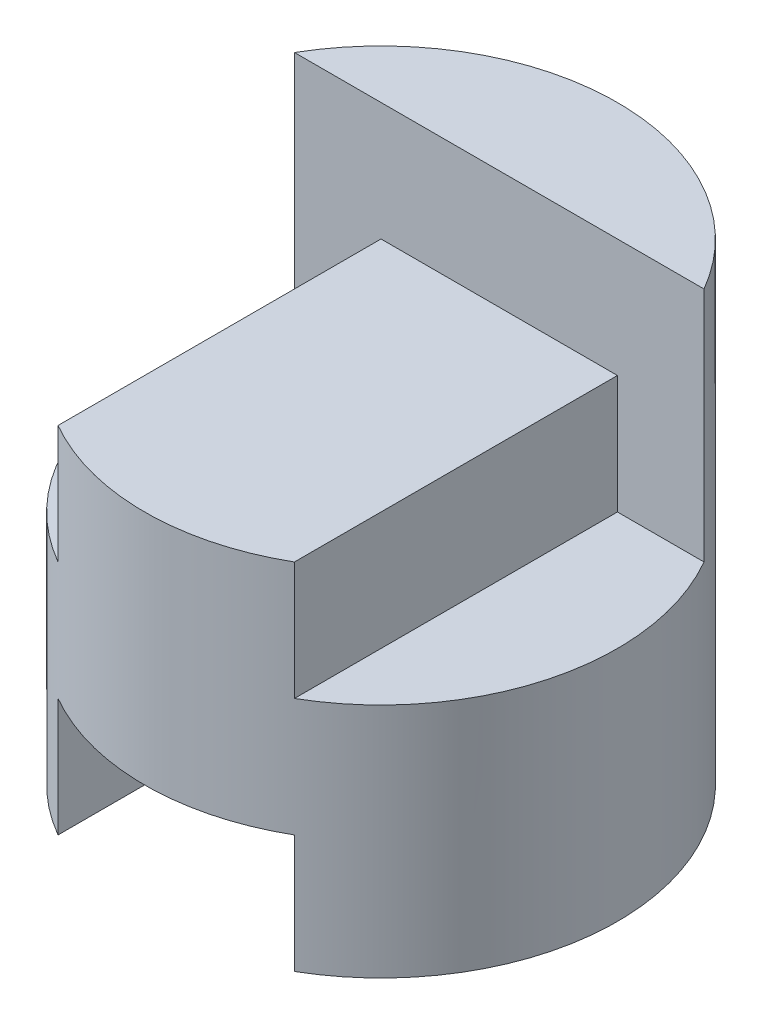
ISO-10303-21;
HEADER;
FILE_DESCRIPTION(('STEP AP214'),'2;1');
FILE_NAME('part.step','',(''),(''),'','','');
FILE_SCHEMA(('AUTOMOTIVE_DESIGN { 1 0 10303 214 1 1 1 1 }'));
ENDSEC;
DATA;
#1=APPLICATION_CONTEXT('core data for automotive mechanical design processes');
#2=APPLICATION_PROTOCOL_DEFINITION('international standard','automotive_design',2000,#1);
#3=PRODUCT_CONTEXT('',#1,'mechanical');
#4=PRODUCT('Part','Part','',(#3));
#5=PRODUCT_RELATED_PRODUCT_CATEGORY('part','',(#4));
#6=PRODUCT_DEFINITION_FORMATION('','',#4);
#7=PRODUCT_DEFINITION_CONTEXT('part definition',#1,'design');
#8=PRODUCT_DEFINITION('design','',#6,#7);
#9=PRODUCT_DEFINITION_SHAPE('','',#8);
#10=(LENGTH_UNIT() NAMED_UNIT(*) SI_UNIT(.MILLI.,.METRE.));
#11=(NAMED_UNIT(*) PLANE_ANGLE_UNIT() SI_UNIT($,.RADIAN.));
#12=(NAMED_UNIT(*) SI_UNIT($,.STERADIAN.) SOLID_ANGLE_UNIT());
#13=UNCERTAINTY_MEASURE_WITH_UNIT(LENGTH_MEASURE(1.E-05),#10,'distance_accuracy_value','');
#14=(GEOMETRIC_REPRESENTATION_CONTEXT(3) GLOBAL_UNCERTAINTY_ASSIGNED_CONTEXT((#13)) GLOBAL_UNIT_ASSIGNED_CONTEXT((#10,
#11,#12)) REPRESENTATION_CONTEXT('',''));
#15=CARTESIAN_POINT('',(0.,0.,0.));
#16=DIRECTION('',(0.,0.,1.));
#17=DIRECTION('',(1.,0.,0.));
#18=AXIS2_PLACEMENT_3D('',#15,#16,#17);
#19=CARTESIAN_POINT('',(0.,4.,0.));
#20=DIRECTION('',(0.,-1.,0.));
#21=DIRECTION('',(0.,0.,-1.));
#22=AXIS2_PLACEMENT_3D('',#19,#20,#21);
#23=CYLINDRICAL_SURFACE('',#22,2.);
#24=CARTESIAN_POINT('',(0.,0.,0.));
#25=DIRECTION('',(0.,1.,0.));
#26=DIRECTION('',(0.,0.,1.));
#27=AXIS2_PLACEMENT_3D('',#24,#25,#26);
#28=CIRCLE('',#27,2.);
#29=CARTESIAN_POINT('',(-1.,0.,-1.73205080756888));
#30=VERTEX_POINT('',#29);
#31=CARTESIAN_POINT('',(-1.,0.,1.73205080756888));
#32=VERTEX_POINT('',#31);
#33=EDGE_CURVE('E163',#30,#32,#28,.T.);
#34=ORIENTED_EDGE('',*,*,#33,.T.);
#35=DIRECTION('',(0.,-1.,0.));
#36=VECTOR('',#35,1.);
#37=CARTESIAN_POINT('',(-1.,4.,1.73205080756888));
#38=LINE('',#37,#36);
#39=CARTESIAN_POINT('',(-1.,1.,1.73205080756888));
#40=VERTEX_POINT('',#39);
#41=EDGE_CURVE('E157',#32,#40,#38,.F.);
#42=ORIENTED_EDGE('',*,*,#41,.T.);
#43=CARTESIAN_POINT('',(0.,1.,0.));
#44=DIRECTION('',(0.,1.,0.));
#45=DIRECTION('',(-1.,0.,0.));
#46=AXIS2_PLACEMENT_3D('',#43,#44,#45);
#47=CIRCLE('',#46,2.);
#48=CARTESIAN_POINT('',(1.,1.,1.73205080756888));
#49=VERTEX_POINT('',#48);
#50=EDGE_CURVE('E175',#40,#49,#47,.T.);
#51=ORIENTED_EDGE('',*,*,#50,.T.);
#52=DIRECTION('',(0.,-1.,0.));
#53=VECTOR('',#52,1.);
#54=CARTESIAN_POINT('',(1.,4.,1.73205080756888));
#55=LINE('',#54,#53);
#56=CARTESIAN_POINT('',(1.,0.,1.73205080756888));
#57=VERTEX_POINT('',#56);
#58=EDGE_CURVE('E154',#49,#57,#55,.T.);
#59=ORIENTED_EDGE('',*,*,#58,.T.);
#60=CARTESIAN_POINT('',(1.,0.,-1.73205080756888));
#61=VERTEX_POINT('',#60);
#62=EDGE_CURVE('E168',#57,#61,#28,.T.);
#63=ORIENTED_EDGE('',*,*,#62,.T.);
#64=DIRECTION('',(0.,-1.,0.));
#65=VECTOR('',#64,1.);
#66=CARTESIAN_POINT('',(1.,4.,-1.73205080756888));
#67=LINE('',#66,#65);
#68=CARTESIAN_POINT('',(1.,1.,-1.73205080756888));
#69=VERTEX_POINT('',#68);
#70=EDGE_CURVE('E55',#61,#69,#67,.F.);
#71=ORIENTED_EDGE('',*,*,#70,.T.);
#72=CARTESIAN_POINT('',(-1.,1.,-1.73205080756888));
#73=VERTEX_POINT('',#72);
#74=EDGE_CURVE('E178',#69,#73,#47,.T.);
#75=ORIENTED_EDGE('',*,*,#74,.T.);
#76=DIRECTION('',(0.,-1.,0.));
#77=VECTOR('',#76,1.);
#78=CARTESIAN_POINT('',(-1.,4.,-1.73205080756888));
#79=LINE('',#78,#77);
#80=EDGE_CURVE('E160',#73,#30,#79,.T.);
#81=ORIENTED_EDGE('',*,*,#80,.T.);
#82=EDGE_LOOP('',(#34,#42,#51,#59,#63,#71,#75,#81));
#83=FACE_BOUND('',#82,.T.);
#84=DIRECTION('',(0.,-1.,0.));
#85=VECTOR('',#84,1.);
#86=CARTESIAN_POINT('',(1.73205080756888,4.,-1.));
#87=LINE('',#86,#85);
#88=CARTESIAN_POINT('',(1.73205080756888,4.,-1.));
#89=VERTEX_POINT('',#88);
#90=CARTESIAN_POINT('',(1.73205080756888,2.,-1.));
#91=VERTEX_POINT('',#90);
#92=EDGE_CURVE('E47',#89,#91,#87,.T.);
#93=ORIENTED_EDGE('',*,*,#92,.T.);
#94=CARTESIAN_POINT('',(0.,2.,0.));
#95=DIRECTION('',(0.,1.,0.));
#96=DIRECTION('',(-1.,0.,0.));
#97=AXIS2_PLACEMENT_3D('',#94,#95,#96);
#98=CIRCLE('',#97,2.);
#99=CARTESIAN_POINT('',(0.999776138398955,2.,1.73218003483705));
#100=VERTEX_POINT('',#99);
#101=EDGE_CURVE('E11',#100,#91,#98,.T.);
#102=ORIENTED_EDGE('',*,*,#101,.F.);
#103=DIRECTION('',(0.,-1.,0.));
#104=VECTOR('',#103,1.);
#105=CARTESIAN_POINT('',(0.999776138398955,4.,1.73218003483705));
#106=LINE('',#105,#104);
#107=CARTESIAN_POINT('',(0.999776138398955,3.,1.73218003483705));
#108=VERTEX_POINT('',#107);
#109=EDGE_CURVE('E40',#108,#100,#106,.T.);
#110=ORIENTED_EDGE('',*,*,#109,.F.);
#111=CARTESIAN_POINT('',(0.,3.,0.));
#112=DIRECTION('',(0.,1.,0.));
#113=DIRECTION('',(0.,0.,1.));
#114=AXIS2_PLACEMENT_3D('',#111,#112,#113);
#115=CIRCLE('',#114,2.);
#116=CARTESIAN_POINT('',(-1.,3.,1.73205080756888));
#117=VERTEX_POINT('',#116);
#118=EDGE_CURVE('E184',#117,#108,#115,.T.);
#119=ORIENTED_EDGE('',*,*,#118,.F.);
#120=DIRECTION('',(0.,-1.,0.));
#121=VECTOR('',#120,1.);
#122=CARTESIAN_POINT('',(-1.,4.,1.73205080756888));
#123=LINE('',#122,#121);
#124=CARTESIAN_POINT('',(-1.,2.,1.73205080756888));
#125=VERTEX_POINT('',#124);
#126=EDGE_CURVE('E182',#125,#117,#123,.F.);
#127=ORIENTED_EDGE('',*,*,#126,.F.);
#128=CARTESIAN_POINT('',(0.,2.,0.));
#129=DIRECTION('',(0.,1.,0.));
#130=DIRECTION('',(-1.,0.,0.));
#131=AXIS2_PLACEMENT_3D('',#128,#129,#130);
#132=CIRCLE('',#131,2.);
#133=CARTESIAN_POINT('',(-1.73205080756888,2.,-1.));
#134=VERTEX_POINT('',#133);
#135=EDGE_CURVE('E115',#134,#125,#132,.T.);
#136=ORIENTED_EDGE('',*,*,#135,.F.);
#137=DIRECTION('',(0.,-1.,0.));
#138=VECTOR('',#137,1.);
#139=CARTESIAN_POINT('',(-1.73205080756888,4.,-1.));
#140=LINE('',#139,#138);
#141=CARTESIAN_POINT('',(-1.73205080756888,4.,-1.));
#142=VERTEX_POINT('',#141);
#143=EDGE_CURVE('E119',#134,#142,#140,.F.);
#144=ORIENTED_EDGE('',*,*,#143,.T.);
#145=CARTESIAN_POINT('',(0.,4.,0.));
#146=DIRECTION('',(0.,1.,0.));
#147=DIRECTION('',(0.,0.,1.));
#148=AXIS2_PLACEMENT_3D('',#145,#146,#147);
#149=CIRCLE('',#148,2.);
#150=EDGE_CURVE('E164',#89,#142,#149,.T.);
#151=ORIENTED_EDGE('',*,*,#150,.F.);
#152=EDGE_LOOP('',(#93,#102,#110,#119,#127,#136,#144,#151));
#153=FACE_BOUND('',#152,.T.);
#154=ADVANCED_FACE('F33',(#83,#153),#23,.T.);
#155=CARTESIAN_POINT('',(0.,0.,0.));
#156=DIRECTION('',(0.,1.,0.));
#157=DIRECTION('',(0.,0.,1.));
#158=AXIS2_PLACEMENT_3D('',#155,#156,#157);
#159=PLANE('',#158);
#160=ORIENTED_EDGE('',*,*,#33,.F.);
#161=DIRECTION('',(0.,0.,1.));
#162=VECTOR('',#161,1.);
#163=CARTESIAN_POINT('',(-1.,0.,0.));
#164=LINE('',#163,#162);
#165=EDGE_CURVE('E172',#30,#32,#164,.T.);
#166=ORIENTED_EDGE('',*,*,#165,.T.);
#167=EDGE_LOOP('',(#160,#166));
#168=FACE_BOUND('',#167,.T.);
#169=ADVANCED_FACE('F202',(#168),#159,.F.);
#170=CARTESIAN_POINT('',(0.,4.,0.));
#171=DIRECTION('',(0.,1.,0.));
#172=DIRECTION('',(0.,0.,1.));
#173=AXIS2_PLACEMENT_3D('',#170,#171,#172);
#174=PLANE('',#173);
#175=DIRECTION('',(-1.,0.,0.));
#176=VECTOR('',#175,1.);
#177=CARTESIAN_POINT('',(0.,4.,-1.));
#178=LINE('',#177,#176);
#179=EDGE_CURVE('E179',#89,#142,#178,.T.);
#180=ORIENTED_EDGE('',*,*,#179,.F.);
#181=ORIENTED_EDGE('',*,*,#150,.T.);
#182=EDGE_LOOP('',(#180,#181));
#183=FACE_BOUND('',#182,.T.);
#184=ADVANCED_FACE('F199',(#183),#174,.T.);
#185=ORIENTED_EDGE('',*,*,#62,.F.);
#186=DIRECTION('',(0.,0.,-1.));
#187=VECTOR('',#186,1.);
#188=CARTESIAN_POINT('',(1.,0.,0.));
#189=LINE('',#188,#187);
#190=EDGE_CURVE('E167',#57,#61,#189,.T.);
#191=ORIENTED_EDGE('',*,*,#190,.T.);
#192=EDGE_LOOP('',(#185,#191));
#193=FACE_BOUND('',#192,.T.);
#194=ADVANCED_FACE('F201',(#193),#159,.F.);
#195=CARTESIAN_POINT('',(-1.,1.,-2.));
#196=DIRECTION('',(0.,1.,0.));
#197=DIRECTION('',(-1.,0.,0.));
#198=AXIS2_PLACEMENT_3D('',#195,#196,#197);
#199=PLANE('',#198);
#200=DIRECTION('',(0.,0.,1.));
#201=VECTOR('',#200,1.);
#202=CARTESIAN_POINT('',(-1.,1.,-2.));
#203=LINE('',#202,#201);
#204=EDGE_CURVE('E148',#73,#40,#203,.T.);
#205=ORIENTED_EDGE('',*,*,#204,.F.);
#206=ORIENTED_EDGE('',*,*,#74,.F.);
#207=DIRECTION('',(0.,0.,1.));
#208=VECTOR('',#207,1.);
#209=CARTESIAN_POINT('',(1.,1.,-2.));
#210=LINE('',#209,#208);
#211=EDGE_CURVE('E147',#69,#49,#210,.T.);
#212=ORIENTED_EDGE('',*,*,#211,.T.);
#213=ORIENTED_EDGE('',*,*,#50,.F.);
#214=EDGE_LOOP('',(#205,#206,#212,#213));
#215=FACE_BOUND('',#214,.T.);
#216=ADVANCED_FACE('F208',(#215),#199,.F.);
#217=CARTESIAN_POINT('',(-1.,0.,-2.));
#218=DIRECTION('',(-1.,0.,0.));
#219=DIRECTION('',(0.,0.,1.));
#220=AXIS2_PLACEMENT_3D('',#217,#218,#219);
#221=PLANE('',#220);
#222=ORIENTED_EDGE('',*,*,#204,.T.);
#223=ORIENTED_EDGE('',*,*,#41,.F.);
#224=ORIENTED_EDGE('',*,*,#165,.F.);
#225=ORIENTED_EDGE('',*,*,#80,.F.);
#226=EDGE_LOOP('',(#222,#223,#224,#225));
#227=FACE_BOUND('',#226,.T.);
#228=ADVANCED_FACE('F219',(#227),#221,.F.);
#229=CARTESIAN_POINT('',(1.,0.,-2.));
#230=DIRECTION('',(1.,0.,0.));
#231=DIRECTION('',(0.,0.,-1.));
#232=AXIS2_PLACEMENT_3D('',#229,#230,#231);
#233=PLANE('',#232);
#234=ORIENTED_EDGE('',*,*,#211,.F.);
#235=ORIENTED_EDGE('',*,*,#70,.F.);
#236=ORIENTED_EDGE('',*,*,#190,.F.);
#237=ORIENTED_EDGE('',*,*,#58,.F.);
#238=EDGE_LOOP('',(#234,#235,#236,#237));
#239=FACE_BOUND('',#238,.T.);
#240=ADVANCED_FACE('F224',(#239),#233,.F.);
#241=CARTESIAN_POINT('',(-1.,2.,4.));
#242=DIRECTION('',(0.,1.,0.));
#243=DIRECTION('',(-1.,0.,0.));
#244=AXIS2_PLACEMENT_3D('',#241,#242,#243);
#245=PLANE('',#244);
#246=ORIENTED_EDGE('',*,*,#135,.T.);
#247=DIRECTION('',(0.,0.,-1.));
#248=VECTOR('',#247,1.);
#249=CARTESIAN_POINT('',(-1.,2.,4.));
#250=LINE('',#249,#248);
#251=CARTESIAN_POINT('',(-1.,2.,-1.));
#252=VERTEX_POINT('',#251);
#253=EDGE_CURVE('E110',#125,#252,#250,.T.);
#254=ORIENTED_EDGE('',*,*,#253,.T.);
#255=DIRECTION('',(1.,0.,0.));
#256=VECTOR('',#255,1.);
#257=CARTESIAN_POINT('',(-1.,2.,-1.));
#258=LINE('',#257,#256);
#259=EDGE_CURVE('E113',#134,#252,#258,.T.);
#260=ORIENTED_EDGE('',*,*,#259,.F.);
#261=EDGE_LOOP('',(#246,#254,#260));
#262=FACE_BOUND('',#261,.T.);
#263=ADVANCED_FACE('F112',(#262),#245,.T.);
#264=CARTESIAN_POINT('',(-1.,2.,4.));
#265=DIRECTION('',(-1.,0.,0.));
#266=DIRECTION('',(0.,0.,1.));
#267=AXIS2_PLACEMENT_3D('',#264,#265,#266);
#268=PLANE('',#267);
#269=ORIENTED_EDGE('',*,*,#126,.T.);
#270=DIRECTION('',(0.,0.,-1.));
#271=VECTOR('',#270,1.);
#272=CARTESIAN_POINT('',(-1.,3.,4.));
#273=LINE('',#272,#271);
#274=CARTESIAN_POINT('',(-1.,3.,-1.));
#275=VERTEX_POINT('',#274);
#276=EDGE_CURVE('E120',#117,#275,#273,.T.);
#277=ORIENTED_EDGE('',*,*,#276,.T.);
#278=DIRECTION('',(0.,1.,0.));
#279=VECTOR('',#278,1.);
#280=CARTESIAN_POINT('',(-1.,2.,-1.));
#281=LINE('',#280,#279);
#282=EDGE_CURVE('E125',#252,#275,#281,.T.);
#283=ORIENTED_EDGE('',*,*,#282,.F.);
#284=ORIENTED_EDGE('',*,*,#253,.F.);
#285=EDGE_LOOP('',(#269,#277,#283,#284));
#286=FACE_BOUND('',#285,.T.);
#287=ADVANCED_FACE('F128',(#286),#268,.T.);
#288=CARTESIAN_POINT('',(-1.,3.,4.));
#289=DIRECTION('',(0.,1.,0.));
#290=DIRECTION('',(0.,0.,1.));
#291=AXIS2_PLACEMENT_3D('',#288,#289,#290);
#292=PLANE('',#291);
#293=ORIENTED_EDGE('',*,*,#118,.T.);
#294=DIRECTION('',(0.,0.,-1.));
#295=VECTOR('',#294,1.);
#296=CARTESIAN_POINT('',(0.999776138398955,3.,4.));
#297=LINE('',#296,#295);
#298=CARTESIAN_POINT('',(0.999776138398955,3.,-1.));
#299=VERTEX_POINT('',#298);
#300=EDGE_CURVE('E142',#108,#299,#297,.T.);
#301=ORIENTED_EDGE('',*,*,#300,.T.);
#302=DIRECTION('',(1.,0.,0.));
#303=VECTOR('',#302,1.);
#304=CARTESIAN_POINT('',(-1.,3.,-1.));
#305=LINE('',#304,#303);
#306=EDGE_CURVE('E131',#275,#299,#305,.T.);
#307=ORIENTED_EDGE('',*,*,#306,.F.);
#308=ORIENTED_EDGE('',*,*,#276,.F.);
#309=EDGE_LOOP('',(#293,#301,#307,#308));
#310=FACE_BOUND('',#309,.T.);
#311=ADVANCED_FACE('F237',(#310),#292,.T.);
#312=CARTESIAN_POINT('',(0.999776138398955,3.,4.));
#313=DIRECTION('',(1.,0.,0.));
#314=DIRECTION('',(0.,0.,-1.));
#315=AXIS2_PLACEMENT_3D('',#312,#313,#314);
#316=PLANE('',#315);
#317=ORIENTED_EDGE('',*,*,#109,.T.);
#318=DIRECTION('',(0.,0.,-1.));
#319=VECTOR('',#318,1.);
#320=CARTESIAN_POINT('',(0.999776138398955,2.,4.));
#321=LINE('',#320,#319);
#322=CARTESIAN_POINT('',(0.999776138398955,2.,-1.));
#323=VERTEX_POINT('',#322);
#324=EDGE_CURVE('E140',#100,#323,#321,.T.);
#325=ORIENTED_EDGE('',*,*,#324,.T.);
#326=DIRECTION('',(0.,-1.,0.));
#327=VECTOR('',#326,1.);
#328=CARTESIAN_POINT('',(0.999776138398955,3.,-1.));
#329=LINE('',#328,#327);
#330=EDGE_CURVE('E133',#299,#323,#329,.T.);
#331=ORIENTED_EDGE('',*,*,#330,.F.);
#332=ORIENTED_EDGE('',*,*,#300,.F.);
#333=EDGE_LOOP('',(#317,#325,#331,#332));
#334=FACE_BOUND('',#333,.T.);
#335=ADVANCED_FACE('F189',(#334),#316,.T.);
#336=CARTESIAN_POINT('',(0.999776138398955,2.,4.));
#337=DIRECTION('',(0.,1.,0.));
#338=DIRECTION('',(-1.,0.,0.));
#339=AXIS2_PLACEMENT_3D('',#336,#337,#338);
#340=PLANE('',#339);
#341=ORIENTED_EDGE('',*,*,#101,.T.);
#342=DIRECTION('',(1.,0.,0.));
#343=VECTOR('',#342,1.);
#344=CARTESIAN_POINT('',(0.999776138398955,2.,-1.));
#345=LINE('',#344,#343);
#346=EDGE_CURVE('E138',#323,#91,#345,.T.);
#347=ORIENTED_EDGE('',*,*,#346,.F.);
#348=ORIENTED_EDGE('',*,*,#324,.F.);
#349=EDGE_LOOP('',(#341,#347,#348));
#350=FACE_BOUND('',#349,.T.);
#351=ADVANCED_FACE('F196',(#350),#340,.T.);
#352=CARTESIAN_POINT('',(0.,0.,-1.));
#353=DIRECTION('',(0.,0.,-1.));
#354=DIRECTION('',(-1.,0.,0.));
#355=AXIS2_PLACEMENT_3D('',#352,#353,#354);
#356=PLANE('',#355);
#357=ORIENTED_EDGE('',*,*,#179,.T.);
#358=ORIENTED_EDGE('',*,*,#143,.F.);
#359=ORIENTED_EDGE('',*,*,#259,.T.);
#360=ORIENTED_EDGE('',*,*,#282,.T.);
#361=ORIENTED_EDGE('',*,*,#306,.T.);
#362=ORIENTED_EDGE('',*,*,#330,.T.);
#363=ORIENTED_EDGE('',*,*,#346,.T.);
#364=ORIENTED_EDGE('',*,*,#92,.F.);
#365=EDGE_LOOP('',(#357,#358,#359,#360,#361,#362,#363,#364));
#366=FACE_BOUND('',#365,.T.);
#367=ADVANCED_FACE('F123',(#366),#356,.F.);
#368=CLOSED_SHELL('',(#154,#169,#184,#194,#216,#228,#240,#263,#287,#311,#335,#351,#367));
#369=MANIFOLD_SOLID_BREP('B2',#368);
#370=ADVANCED_BREP_SHAPE_REPRESENTATION('',(#18,#369),#14);
#371=SHAPE_DEFINITION_REPRESENTATION(#9,#370);
ENDSEC;
END-ISO-10303-21;
